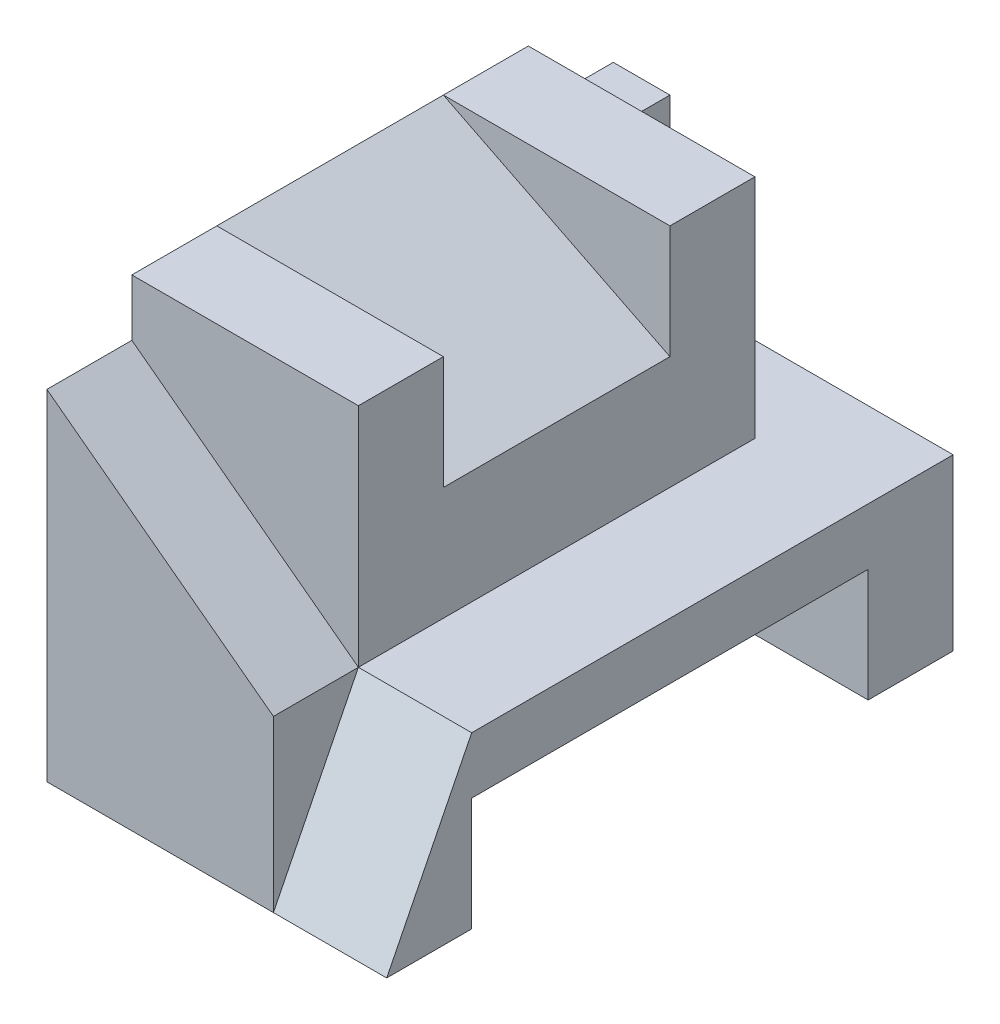
ISO-10303-21;
HEADER;
FILE_DESCRIPTION(('STEP AP214'),'2;1');
FILE_NAME('part.step','',(''),(''),'','','');
FILE_SCHEMA(('AUTOMOTIVE_DESIGN { 1 0 10303 214 1 1 1 1 }'));
ENDSEC;
DATA;
#1=APPLICATION_CONTEXT('core data for automotive mechanical design processes');
#2=APPLICATION_PROTOCOL_DEFINITION('international standard','automotive_design',2000,#1);
#3=PRODUCT_CONTEXT('',#1,'mechanical');
#4=PRODUCT('Part','Part','',(#3));
#5=PRODUCT_RELATED_PRODUCT_CATEGORY('part','',(#4));
#6=PRODUCT_DEFINITION_FORMATION('','',#4);
#7=PRODUCT_DEFINITION_CONTEXT('part definition',#1,'design');
#8=PRODUCT_DEFINITION('design','',#6,#7);
#9=PRODUCT_DEFINITION_SHAPE('','',#8);
#10=(LENGTH_UNIT() NAMED_UNIT(*) SI_UNIT(.MILLI.,.METRE.));
#11=(NAMED_UNIT(*) PLANE_ANGLE_UNIT() SI_UNIT($,.RADIAN.));
#12=(NAMED_UNIT(*) SI_UNIT($,.STERADIAN.) SOLID_ANGLE_UNIT());
#13=UNCERTAINTY_MEASURE_WITH_UNIT(LENGTH_MEASURE(1.E-05),#10,'distance_accuracy_value','');
#14=(GEOMETRIC_REPRESENTATION_CONTEXT(3) GLOBAL_UNCERTAINTY_ASSIGNED_CONTEXT((#13)) GLOBAL_UNIT_ASSIGNED_CONTEXT((#10,
#11,#12)) REPRESENTATION_CONTEXT('',''));
#15=CARTESIAN_POINT('',(0.,0.,0.));
#16=DIRECTION('',(0.,0.,1.));
#17=DIRECTION('',(1.,0.,0.));
#18=AXIS2_PLACEMENT_3D('',#15,#16,#17);
#19=CARTESIAN_POINT('',(4.,7.,-10.));
#20=DIRECTION('',(0.,1.,0.));
#21=DIRECTION('',(-1.,0.,0.));
#22=AXIS2_PLACEMENT_3D('',#19,#20,#21);
#23=PLANE('',#22);
#24=DIRECTION('',(0.,0.,1.));
#25=VECTOR('',#24,1.);
#26=CARTESIAN_POINT('',(4.,7.,-10.));
#27=LINE('',#26,#25);
#28=CARTESIAN_POINT('',(4.,7.,-3.));
#29=VERTEX_POINT('',#28);
#30=CARTESIAN_POINT('',(4.,7.,-1.5));
#31=VERTEX_POINT('',#30);
#32=EDGE_CURVE('E294',#29,#31,#27,.T.);
#33=ORIENTED_EDGE('',*,*,#32,.F.);
#34=DIRECTION('',(-1.,0.,0.));
#35=VECTOR('',#34,1.);
#36=CARTESIAN_POINT('',(4.,7.,-3.));
#37=LINE('',#36,#35);
#38=CARTESIAN_POINT('',(0.,7.,-3.));
#39=VERTEX_POINT('',#38);
#40=EDGE_CURVE('E187',#29,#39,#37,.T.);
#41=ORIENTED_EDGE('',*,*,#40,.T.);
#42=DIRECTION('',(0.,0.,1.));
#43=VECTOR('',#42,1.);
#44=CARTESIAN_POINT('',(0.,7.,-10.));
#45=LINE('',#44,#43);
#46=CARTESIAN_POINT('',(0.,7.,-1.5));
#47=VERTEX_POINT('',#46);
#48=EDGE_CURVE('E43',#39,#47,#45,.T.);
#49=ORIENTED_EDGE('',*,*,#48,.T.);
#50=DIRECTION('',(-1.,0.,0.));
#51=VECTOR('',#50,1.);
#52=CARTESIAN_POINT('',(0.,7.,-1.5));
#53=LINE('',#52,#51);
#54=EDGE_CURVE('E262',#31,#47,#53,.T.);
#55=ORIENTED_EDGE('',*,*,#54,.F.);
#56=EDGE_LOOP('',(#33,#41,#49,#55));
#57=FACE_BOUND('',#56,.T.);
#58=ADVANCED_FACE('F34',(#57),#23,.T.);
#59=CARTESIAN_POINT('',(0.,0.,-10.));
#60=DIRECTION('',(0.,-1.,0.));
#61=DIRECTION('',(0.,0.,-1.));
#62=AXIS2_PLACEMENT_3D('',#59,#60,#61);
#63=PLANE('',#62);
#64=DIRECTION('',(1.,0.,0.));
#65=VECTOR('',#64,1.);
#66=CARTESIAN_POINT('',(-0.00100000000000013,0.,-1.5));
#67=LINE('',#66,#65);
#68=CARTESIAN_POINT('',(0.,0.,-1.5));
#69=VERTEX_POINT('',#68);
#70=CARTESIAN_POINT('',(6.,0.,-1.5));
#71=VERTEX_POINT('',#70);
#72=EDGE_CURVE('E236',#69,#71,#67,.T.);
#73=ORIENTED_EDGE('',*,*,#72,.T.);
#74=DIRECTION('',(0.,0.,1.));
#75=VECTOR('',#74,1.);
#76=CARTESIAN_POINT('',(6.,0.,-10.));
#77=LINE('',#76,#75);
#78=CARTESIAN_POINT('',(6.,0.,0.));
#79=VERTEX_POINT('',#78);
#80=EDGE_CURVE('E301',#71,#79,#77,.T.);
#81=ORIENTED_EDGE('',*,*,#80,.T.);
#82=DIRECTION('',(1.,0.,0.));
#83=VECTOR('',#82,1.);
#84=CARTESIAN_POINT('',(4.,0.,0.));
#85=LINE('',#84,#83);
#86=CARTESIAN_POINT('',(4.,0.,0.));
#87=VERTEX_POINT('',#86);
#88=EDGE_CURVE('E251',#87,#79,#85,.T.);
#89=ORIENTED_EDGE('',*,*,#88,.F.);
#90=DIRECTION('',(1.,0.,0.));
#91=VECTOR('',#90,1.);
#92=CARTESIAN_POINT('',(0.,0.,0.));
#93=LINE('',#92,#91);
#94=CARTESIAN_POINT('',(0.,0.,0.));
#95=VERTEX_POINT('',#94);
#96=EDGE_CURVE('E280',#95,#87,#93,.T.);
#97=ORIENTED_EDGE('',*,*,#96,.F.);
#98=DIRECTION('',(0.,0.,1.));
#99=VECTOR('',#98,1.);
#100=CARTESIAN_POINT('',(0.,0.,-10.));
#101=LINE('',#100,#99);
#102=EDGE_CURVE('E288',#69,#95,#101,.T.);
#103=ORIENTED_EDGE('',*,*,#102,.F.);
#104=EDGE_LOOP('',(#73,#81,#89,#97,#103));
#105=FACE_BOUND('',#104,.T.);
#106=ADVANCED_FACE('F317',(#105),#63,.T.);
#107=CARTESIAN_POINT('',(0.,0.,0.));
#108=DIRECTION('',(0.,0.,1.));
#109=DIRECTION('',(1.,0.,0.));
#110=AXIS2_PLACEMENT_3D('',#107,#108,#109);
#111=PLANE('',#110);
#112=ORIENTED_EDGE('',*,*,#96,.T.);
#113=DIRECTION('',(0.,-1.,0.));
#114=VECTOR('',#113,1.);
#115=CARTESIAN_POINT('',(4.,0.,0.));
#116=LINE('',#115,#114);
#117=CARTESIAN_POINT('',(4.,3.,0.));
#118=VERTEX_POINT('',#117);
#119=EDGE_CURVE('E246',#118,#87,#116,.T.);
#120=ORIENTED_EDGE('',*,*,#119,.F.);
#121=DIRECTION('',(0.8,-0.6,0.));
#122=VECTOR('',#121,1.);
#123=CARTESIAN_POINT('',(4.,3.,0.));
#124=LINE('',#123,#122);
#125=CARTESIAN_POINT('',(0.,6.,0.));
#126=VERTEX_POINT('',#125);
#127=EDGE_CURVE('E256',#126,#118,#124,.T.);
#128=ORIENTED_EDGE('',*,*,#127,.F.);
#129=DIRECTION('',(0.,-1.,0.));
#130=VECTOR('',#129,1.);
#131=CARTESIAN_POINT('',(0.,7.,0.));
#132=LINE('',#131,#130);
#133=EDGE_CURVE('E275',#126,#95,#132,.T.);
#134=ORIENTED_EDGE('',*,*,#133,.T.);
#135=EDGE_LOOP('',(#112,#120,#128,#134));
#136=FACE_BOUND('',#135,.T.);
#137=ADVANCED_FACE('F315',(#136),#111,.T.);
#138=DIRECTION('',(-1.,0.,0.));
#139=VECTOR('',#138,1.);
#140=CARTESIAN_POINT('',(4.,7.,-7.));
#141=LINE('',#140,#139);
#142=CARTESIAN_POINT('',(4.,7.,-7.));
#143=VERTEX_POINT('',#142);
#144=CARTESIAN_POINT('',(0.,7.,-7.));
#145=VERTEX_POINT('',#144);
#146=EDGE_CURVE('E51',#143,#145,#141,.T.);
#147=ORIENTED_EDGE('',*,*,#146,.F.);
#148=CARTESIAN_POINT('',(4.,7.,-8.5));
#149=VERTEX_POINT('',#148);
#150=EDGE_CURVE('E182',#149,#143,#27,.T.);
#151=ORIENTED_EDGE('',*,*,#150,.F.);
#152=DIRECTION('',(1.,0.,0.));
#153=VECTOR('',#152,1.);
#154=CARTESIAN_POINT('',(4.,7.,-8.5));
#155=LINE('',#154,#153);
#156=CARTESIAN_POINT('',(0.,7.,-8.5));
#157=VERTEX_POINT('',#156);
#158=EDGE_CURVE('E208',#157,#149,#155,.T.);
#159=ORIENTED_EDGE('',*,*,#158,.F.);
#160=EDGE_CURVE('E11',#157,#145,#45,.T.);
#161=ORIENTED_EDGE('',*,*,#160,.T.);
#162=EDGE_LOOP('',(#147,#151,#159,#161));
#163=FACE_BOUND('',#162,.T.);
#164=ADVANCED_FACE('F373',(#163),#23,.T.);
#165=CARTESIAN_POINT('',(4.,3.,-10.));
#166=DIRECTION('',(1.,0.,0.));
#167=DIRECTION('',(0.,0.,-1.));
#168=AXIS2_PLACEMENT_3D('',#165,#166,#167);
#169=PLANE('',#168);
#170=DIRECTION('',(0.,1.,0.));
#171=VECTOR('',#170,1.);
#172=CARTESIAN_POINT('',(4.,5.,-7.));
#173=LINE('',#172,#171);
#174=CARTESIAN_POINT('',(4.,5.,-7.));
#175=VERTEX_POINT('',#174);
#176=EDGE_CURVE('E176',#175,#143,#173,.T.);
#177=ORIENTED_EDGE('',*,*,#176,.F.);
#178=DIRECTION('',(0.,0.,1.));
#179=VECTOR('',#178,1.);
#180=CARTESIAN_POINT('',(4.,5.,-7.));
#181=LINE('',#180,#179);
#182=CARTESIAN_POINT('',(4.,5.,-3.));
#183=VERTEX_POINT('',#182);
#184=EDGE_CURVE('E162',#175,#183,#181,.T.);
#185=ORIENTED_EDGE('',*,*,#184,.T.);
#186=DIRECTION('',(0.,1.,0.));
#187=VECTOR('',#186,1.);
#188=CARTESIAN_POINT('',(4.,5.,-3.));
#189=LINE('',#188,#187);
#190=EDGE_CURVE('E191',#183,#29,#189,.T.);
#191=ORIENTED_EDGE('',*,*,#190,.T.);
#192=ORIENTED_EDGE('',*,*,#32,.T.);
#193=DIRECTION('',(0.,1.,0.));
#194=VECTOR('',#193,1.);
#195=CARTESIAN_POINT('',(4.,7.,-1.5));
#196=LINE('',#195,#194);
#197=CARTESIAN_POINT('',(4.,3.,-1.5));
#198=VERTEX_POINT('',#197);
#199=EDGE_CURVE('E259',#198,#31,#196,.T.);
#200=ORIENTED_EDGE('',*,*,#199,.F.);
#201=DIRECTION('',(0.,0.,1.));
#202=VECTOR('',#201,1.);
#203=CARTESIAN_POINT('',(4.,3.,-10.));
#204=LINE('',#203,#202);
#205=CARTESIAN_POINT('',(4.,3.,-8.5));
#206=VERTEX_POINT('',#205);
#207=EDGE_CURVE('E295',#206,#198,#204,.T.);
#208=ORIENTED_EDGE('',*,*,#207,.F.);
#209=DIRECTION('',(0.,-1.,0.));
#210=VECTOR('',#209,1.);
#211=CARTESIAN_POINT('',(4.,3.,-8.5));
#212=LINE('',#211,#210);
#213=EDGE_CURVE('E193',#149,#206,#212,.T.);
#214=ORIENTED_EDGE('',*,*,#213,.F.);
#215=ORIENTED_EDGE('',*,*,#150,.T.);
#216=EDGE_LOOP('',(#177,#185,#191,#192,#200,#208,#214,#215));
#217=FACE_BOUND('',#216,.T.);
#218=ADVANCED_FACE('F179',(#217),#169,.T.);
#219=CARTESIAN_POINT('',(0.,7.,-10.));
#220=DIRECTION('',(-1.,0.,0.));
#221=DIRECTION('',(0.,-1.,0.));
#222=AXIS2_PLACEMENT_3D('',#219,#220,#221);
#223=PLANE('',#222);
#224=DIRECTION('',(0.,0.,-1.));
#225=VECTOR('',#224,1.);
#226=CARTESIAN_POINT('',(0.,6.,-8.5));
#227=LINE('',#226,#225);
#228=CARTESIAN_POINT('',(0.,6.,-8.5));
#229=VERTEX_POINT('',#228);
#230=CARTESIAN_POINT('',(0.,6.,-10.));
#231=VERTEX_POINT('',#230);
#232=EDGE_CURVE('E214',#229,#231,#227,.T.);
#233=ORIENTED_EDGE('',*,*,#232,.T.);
#234=DIRECTION('',(0.,-1.,0.));
#235=VECTOR('',#234,1.);
#236=CARTESIAN_POINT('',(0.,7.,-10.));
#237=LINE('',#236,#235);
#238=CARTESIAN_POINT('',(0.,0.,-10.));
#239=VERTEX_POINT('',#238);
#240=EDGE_CURVE('E277',#231,#239,#237,.T.);
#241=ORIENTED_EDGE('',*,*,#240,.T.);
#242=CARTESIAN_POINT('',(0.,0.,-8.5));
#243=VERTEX_POINT('',#242);
#244=EDGE_CURVE('E38',#239,#243,#101,.T.);
#245=ORIENTED_EDGE('',*,*,#244,.T.);
#246=DIRECTION('',(0.,1.,0.));
#247=VECTOR('',#246,1.);
#248=CARTESIAN_POINT('',(0.,2.,-8.5));
#249=LINE('',#248,#247);
#250=CARTESIAN_POINT('',(0.,2.,-8.5));
#251=VERTEX_POINT('',#250);
#252=EDGE_CURVE('E59',#243,#251,#249,.T.);
#253=ORIENTED_EDGE('',*,*,#252,.T.);
#254=DIRECTION('',(0.,0.,1.));
#255=VECTOR('',#254,1.);
#256=CARTESIAN_POINT('',(0.,2.,-1.5));
#257=LINE('',#256,#255);
#258=CARTESIAN_POINT('',(0.,2.,-1.5));
#259=VERTEX_POINT('',#258);
#260=EDGE_CURVE('E217',#251,#259,#257,.T.);
#261=ORIENTED_EDGE('',*,*,#260,.T.);
#262=DIRECTION('',(0.,-1.,0.));
#263=VECTOR('',#262,1.);
#264=CARTESIAN_POINT('',(0.,0.,-1.5));
#265=LINE('',#264,#263);
#266=EDGE_CURVE('E224',#259,#69,#265,.T.);
#267=ORIENTED_EDGE('',*,*,#266,.T.);
#268=ORIENTED_EDGE('',*,*,#102,.T.);
#269=ORIENTED_EDGE('',*,*,#133,.F.);
#270=DIRECTION('',(0.,0.,1.));
#271=VECTOR('',#270,1.);
#272=CARTESIAN_POINT('',(0.,6.,-1.5));
#273=LINE('',#272,#271);
#274=CARTESIAN_POINT('',(0.,6.,-1.5));
#275=VERTEX_POINT('',#274);
#276=EDGE_CURVE('E270',#275,#126,#273,.T.);
#277=ORIENTED_EDGE('',*,*,#276,.F.);
#278=DIRECTION('',(0.,-1.,0.));
#279=VECTOR('',#278,1.);
#280=CARTESIAN_POINT('',(0.,6.,-1.5));
#281=LINE('',#280,#279);
#282=EDGE_CURVE('E265',#47,#275,#281,.T.);
#283=ORIENTED_EDGE('',*,*,#282,.F.);
#284=ORIENTED_EDGE('',*,*,#48,.F.);
#285=DIRECTION('',(0.,0.,1.));
#286=VECTOR('',#285,1.);
#287=CARTESIAN_POINT('',(0.,7.,-7.));
#288=LINE('',#287,#286);
#289=EDGE_CURVE('E173',#145,#39,#288,.T.);
#290=ORIENTED_EDGE('',*,*,#289,.F.);
#291=ORIENTED_EDGE('',*,*,#160,.F.);
#292=DIRECTION('',(0.,1.,0.));
#293=VECTOR('',#292,1.);
#294=CARTESIAN_POINT('',(0.,6.,-8.5));
#295=LINE('',#294,#293);
#296=EDGE_CURVE('E206',#229,#157,#295,.T.);
#297=ORIENTED_EDGE('',*,*,#296,.F.);
#298=EDGE_LOOP('',(#233,#241,#245,#253,#261,#267,#268,#269,#277,#283,#284,#290,#291,#297));
#299=FACE_BOUND('',#298,.T.);
#300=ADVANCED_FACE('F36',(#299),#223,.T.);
#301=CARTESIAN_POINT('',(6.,3.,-10.));
#302=DIRECTION('',(0.,1.,0.));
#303=DIRECTION('',(-1.,0.,0.));
#304=AXIS2_PLACEMENT_3D('',#301,#302,#303);
#305=PLANE('',#304);
#306=DIRECTION('',(1.,0.,0.));
#307=VECTOR('',#306,1.);
#308=CARTESIAN_POINT('',(4.,3.,-1.5));
#309=LINE('',#308,#307);
#310=CARTESIAN_POINT('',(6.,3.,-1.5));
#311=VERTEX_POINT('',#310);
#312=EDGE_CURVE('E253',#198,#311,#309,.T.);
#313=ORIENTED_EDGE('',*,*,#312,.T.);
#314=DIRECTION('',(0.,0.,1.));
#315=VECTOR('',#314,1.);
#316=CARTESIAN_POINT('',(6.,3.,-10.));
#317=LINE('',#316,#315);
#318=CARTESIAN_POINT('',(6.,3.,-10.));
#319=VERTEX_POINT('',#318);
#320=EDGE_CURVE('E297',#319,#311,#317,.T.);
#321=ORIENTED_EDGE('',*,*,#320,.F.);
#322=DIRECTION('',(-1.,0.,0.));
#323=VECTOR('',#322,1.);
#324=CARTESIAN_POINT('',(6.,3.,-10.));
#325=LINE('',#324,#323);
#326=CARTESIAN_POINT('',(1.,3.,-10.));
#327=VERTEX_POINT('',#326);
#328=EDGE_CURVE('E286',#319,#327,#325,.T.);
#329=ORIENTED_EDGE('',*,*,#328,.T.);
#330=DIRECTION('',(0.,0.,-1.));
#331=VECTOR('',#330,1.);
#332=CARTESIAN_POINT('',(1.,3.,-8.5));
#333=LINE('',#332,#331);
#334=CARTESIAN_POINT('',(1.,3.,-8.5));
#335=VERTEX_POINT('',#334);
#336=EDGE_CURVE('E210',#335,#327,#333,.T.);
#337=ORIENTED_EDGE('',*,*,#336,.F.);
#338=DIRECTION('',(-1.,0.,0.));
#339=VECTOR('',#338,1.);
#340=CARTESIAN_POINT('',(4.,3.,-8.5));
#341=LINE('',#340,#339);
#342=EDGE_CURVE('E196',#206,#335,#341,.T.);
#343=ORIENTED_EDGE('',*,*,#342,.F.);
#344=ORIENTED_EDGE('',*,*,#207,.T.);
#345=EDGE_LOOP('',(#313,#321,#329,#337,#343,#344));
#346=FACE_BOUND('',#345,.T.);
#347=ADVANCED_FACE('F329',(#346),#305,.T.);
#348=CARTESIAN_POINT('',(6.,0.,-10.));
#349=DIRECTION('',(1.,0.,0.));
#350=DIRECTION('',(0.,0.,-1.));
#351=AXIS2_PLACEMENT_3D('',#348,#349,#350);
#352=PLANE('',#351);
#353=DIRECTION('',(0.,-1.,0.));
#354=VECTOR('',#353,1.);
#355=CARTESIAN_POINT('',(6.,0.,-1.5));
#356=LINE('',#355,#354);
#357=CARTESIAN_POINT('',(6.,2.,-1.5));
#358=VERTEX_POINT('',#357);
#359=EDGE_CURVE('E233',#358,#71,#356,.T.);
#360=ORIENTED_EDGE('',*,*,#359,.F.);
#361=DIRECTION('',(0.,0.,1.));
#362=VECTOR('',#361,1.);
#363=CARTESIAN_POINT('',(6.,2.,-1.5));
#364=LINE('',#363,#362);
#365=CARTESIAN_POINT('',(6.,2.,-8.5));
#366=VERTEX_POINT('',#365);
#367=EDGE_CURVE('E230',#366,#358,#364,.T.);
#368=ORIENTED_EDGE('',*,*,#367,.F.);
#369=DIRECTION('',(0.,1.,0.));
#370=VECTOR('',#369,1.);
#371=CARTESIAN_POINT('',(6.,2.,-8.5));
#372=LINE('',#371,#370);
#373=CARTESIAN_POINT('',(6.,0.,-8.5));
#374=VERTEX_POINT('',#373);
#375=EDGE_CURVE('E227',#374,#366,#372,.T.);
#376=ORIENTED_EDGE('',*,*,#375,.F.);
#377=CARTESIAN_POINT('',(6.,0.,-10.));
#378=VERTEX_POINT('',#377);
#379=EDGE_CURVE('E299',#378,#374,#77,.T.);
#380=ORIENTED_EDGE('',*,*,#379,.F.);
#381=DIRECTION('',(0.,1.,0.));
#382=VECTOR('',#381,1.);
#383=CARTESIAN_POINT('',(6.,0.,-10.));
#384=LINE('',#383,#382);
#385=EDGE_CURVE('E283',#378,#319,#384,.T.);
#386=ORIENTED_EDGE('',*,*,#385,.T.);
#387=ORIENTED_EDGE('',*,*,#320,.T.);
#388=DIRECTION('',(0.,0.894427190999916,-0.447213595499958));
#389=VECTOR('',#388,1.);
#390=CARTESIAN_POINT('',(6.,3.,-1.5));
#391=LINE('',#390,#389);
#392=EDGE_CURVE('E245',#79,#311,#391,.T.);
#393=ORIENTED_EDGE('',*,*,#392,.F.);
#394=ORIENTED_EDGE('',*,*,#80,.F.);
#395=EDGE_LOOP('',(#360,#368,#376,#380,#386,#387,#393,#394));
#396=FACE_BOUND('',#395,.T.);
#397=ADVANCED_FACE('F325',(#396),#352,.T.);
#398=DIRECTION('',(1.,0.,0.));
#399=VECTOR('',#398,1.);
#400=CARTESIAN_POINT('',(-0.00100000000000013,0.,-8.5));
#401=LINE('',#400,#399);
#402=EDGE_CURVE('E235',#243,#374,#401,.T.);
#403=ORIENTED_EDGE('',*,*,#402,.F.);
#404=ORIENTED_EDGE('',*,*,#244,.F.);
#405=DIRECTION('',(1.,0.,0.));
#406=VECTOR('',#405,1.);
#407=CARTESIAN_POINT('',(0.,0.,-10.));
#408=LINE('',#407,#406);
#409=EDGE_CURVE('E279',#239,#378,#408,.T.);
#410=ORIENTED_EDGE('',*,*,#409,.T.);
#411=ORIENTED_EDGE('',*,*,#379,.T.);
#412=EDGE_LOOP('',(#403,#404,#410,#411));
#413=FACE_BOUND('',#412,.T.);
#414=ADVANCED_FACE('F377',(#413),#63,.T.);
#415=CARTESIAN_POINT('',(0.,0.,-10.));
#416=DIRECTION('',(0.,0.,1.));
#417=DIRECTION('',(1.,0.,0.));
#418=AXIS2_PLACEMENT_3D('',#415,#416,#417);
#419=PLANE('',#418);
#420=ORIENTED_EDGE('',*,*,#240,.F.);
#421=DIRECTION('',(-1.,0.,0.));
#422=VECTOR('',#421,1.);
#423=CARTESIAN_POINT('',(1.,6.,-10.));
#424=LINE('',#423,#422);
#425=CARTESIAN_POINT('',(1.,6.,-10.));
#426=VERTEX_POINT('',#425);
#427=EDGE_CURVE('E197',#426,#231,#424,.T.);
#428=ORIENTED_EDGE('',*,*,#427,.F.);
#429=DIRECTION('',(0.,1.,0.));
#430=VECTOR('',#429,1.);
#431=CARTESIAN_POINT('',(1.,3.,-10.));
#432=LINE('',#431,#430);
#433=EDGE_CURVE('E172',#327,#426,#432,.T.);
#434=ORIENTED_EDGE('',*,*,#433,.F.);
#435=ORIENTED_EDGE('',*,*,#328,.F.);
#436=ORIENTED_EDGE('',*,*,#385,.F.);
#437=ORIENTED_EDGE('',*,*,#409,.F.);
#438=EDGE_LOOP('',(#420,#428,#434,#435,#436,#437));
#439=FACE_BOUND('',#438,.T.);
#440=ADVANCED_FACE('F333',(#439),#419,.F.);
#441=CARTESIAN_POINT('',(4.,3.,-1.5));
#442=DIRECTION('',(-0.6,-0.8,0.));
#443=DIRECTION('',(0.8,-0.6,0.));
#444=AXIS2_PLACEMENT_3D('',#441,#442,#443);
#445=PLANE('',#444);
#446=ORIENTED_EDGE('',*,*,#127,.T.);
#447=DIRECTION('',(0.,0.,1.));
#448=VECTOR('',#447,1.);
#449=CARTESIAN_POINT('',(4.,3.,-1.5));
#450=LINE('',#449,#448);
#451=EDGE_CURVE('E273',#198,#118,#450,.T.);
#452=ORIENTED_EDGE('',*,*,#451,.F.);
#453=DIRECTION('',(0.8,-0.6,0.));
#454=VECTOR('',#453,1.);
#455=CARTESIAN_POINT('',(4.,3.,-1.5));
#456=LINE('',#455,#454);
#457=EDGE_CURVE('E267',#275,#198,#456,.T.);
#458=ORIENTED_EDGE('',*,*,#457,.F.);
#459=ORIENTED_EDGE('',*,*,#276,.T.);
#460=EDGE_LOOP('',(#446,#452,#458,#459));
#461=FACE_BOUND('',#460,.T.);
#462=ADVANCED_FACE('F356',(#461),#445,.F.);
#463=CARTESIAN_POINT('',(0.,0.,-1.5));
#464=DIRECTION('',(0.,0.,1.));
#465=DIRECTION('',(1.,0.,0.));
#466=AXIS2_PLACEMENT_3D('',#463,#464,#465);
#467=PLANE('',#466);
#468=ORIENTED_EDGE('',*,*,#199,.T.);
#469=ORIENTED_EDGE('',*,*,#54,.T.);
#470=ORIENTED_EDGE('',*,*,#282,.T.);
#471=ORIENTED_EDGE('',*,*,#457,.T.);
#472=EDGE_LOOP('',(#468,#469,#470,#471));
#473=FACE_BOUND('',#472,.T.);
#474=ADVANCED_FACE('F348',(#473),#467,.T.);
#475=CARTESIAN_POINT('',(4.,3.,-1.5));
#476=DIRECTION('',(0.,-0.447213595499958,-0.894427190999916));
#477=DIRECTION('',(0.,0.894427190999916,-0.447213595499958));
#478=AXIS2_PLACEMENT_3D('',#475,#476,#477);
#479=PLANE('',#478);
#480=ORIENTED_EDGE('',*,*,#392,.T.);
#481=ORIENTED_EDGE('',*,*,#312,.F.);
#482=DIRECTION('',(0.,0.894427190999916,-0.447213595499958));
#483=VECTOR('',#482,1.);
#484=CARTESIAN_POINT('',(4.,3.,-1.5));
#485=LINE('',#484,#483);
#486=EDGE_CURVE('E248',#87,#198,#485,.T.);
#487=ORIENTED_EDGE('',*,*,#486,.F.);
#488=ORIENTED_EDGE('',*,*,#88,.T.);
#489=EDGE_LOOP('',(#480,#481,#487,#488));
#490=FACE_BOUND('',#489,.T.);
#491=ADVANCED_FACE('F321',(#490),#479,.F.);
#492=CARTESIAN_POINT('',(4.,0.,0.));
#493=DIRECTION('',(1.,0.,0.));
#494=DIRECTION('',(0.,0.,-1.));
#495=AXIS2_PLACEMENT_3D('',#492,#493,#494);
#496=PLANE('',#495);
#497=ORIENTED_EDGE('',*,*,#451,.T.);
#498=ORIENTED_EDGE('',*,*,#119,.T.);
#499=ORIENTED_EDGE('',*,*,#486,.T.);
#500=EDGE_LOOP('',(#497,#498,#499));
#501=FACE_BOUND('',#500,.T.);
#502=ADVANCED_FACE('F358',(#501),#496,.T.);
#503=CARTESIAN_POINT('',(-0.00100000000000013,0.,-1.5));
#504=DIRECTION('',(0.,0.,1.));
#505=DIRECTION('',(1.,0.,0.));
#506=AXIS2_PLACEMENT_3D('',#503,#504,#505);
#507=PLANE('',#506);
#508=DIRECTION('',(1.,0.,0.));
#509=VECTOR('',#508,1.);
#510=CARTESIAN_POINT('',(-0.00100000000000013,2.,-1.5));
#511=LINE('',#510,#509);
#512=EDGE_CURVE('E239',#259,#358,#511,.T.);
#513=ORIENTED_EDGE('',*,*,#512,.T.);
#514=ORIENTED_EDGE('',*,*,#359,.T.);
#515=ORIENTED_EDGE('',*,*,#72,.F.);
#516=ORIENTED_EDGE('',*,*,#266,.F.);
#517=EDGE_LOOP('',(#513,#514,#515,#516));
#518=FACE_BOUND('',#517,.T.);
#519=ADVANCED_FACE('F360',(#518),#507,.F.);
#520=CARTESIAN_POINT('',(-0.00100000000000013,2.,-1.5));
#521=DIRECTION('',(0.,1.,0.));
#522=DIRECTION('',(0.,0.,1.));
#523=AXIS2_PLACEMENT_3D('',#520,#521,#522);
#524=PLANE('',#523);
#525=DIRECTION('',(1.,0.,0.));
#526=VECTOR('',#525,1.);
#527=CARTESIAN_POINT('',(-0.00100000000000013,2.,-8.5));
#528=LINE('',#527,#526);
#529=EDGE_CURVE('E241',#251,#366,#528,.T.);
#530=ORIENTED_EDGE('',*,*,#529,.T.);
#531=ORIENTED_EDGE('',*,*,#367,.T.);
#532=ORIENTED_EDGE('',*,*,#512,.F.);
#533=ORIENTED_EDGE('',*,*,#260,.F.);
#534=EDGE_LOOP('',(#530,#531,#532,#533));
#535=FACE_BOUND('',#534,.T.);
#536=ADVANCED_FACE('F366',(#535),#524,.F.);
#537=CARTESIAN_POINT('',(-0.00100000000000013,2.,-8.5));
#538=DIRECTION('',(0.,0.,-1.));
#539=DIRECTION('',(-1.,0.,0.));
#540=AXIS2_PLACEMENT_3D('',#537,#538,#539);
#541=PLANE('',#540);
#542=ORIENTED_EDGE('',*,*,#402,.T.);
#543=ORIENTED_EDGE('',*,*,#375,.T.);
#544=ORIENTED_EDGE('',*,*,#529,.F.);
#545=ORIENTED_EDGE('',*,*,#252,.F.);
#546=EDGE_LOOP('',(#542,#543,#544,#545));
#547=FACE_BOUND('',#546,.T.);
#548=ADVANCED_FACE('F390',(#547),#541,.F.);
#549=CARTESIAN_POINT('',(1.,6.,-8.5));
#550=DIRECTION('',(0.,-1.,0.));
#551=DIRECTION('',(0.,0.,-1.));
#552=AXIS2_PLACEMENT_3D('',#549,#550,#551);
#553=PLANE('',#552);
#554=ORIENTED_EDGE('',*,*,#427,.T.);
#555=ORIENTED_EDGE('',*,*,#232,.F.);
#556=DIRECTION('',(-1.,0.,0.));
#557=VECTOR('',#556,1.);
#558=CARTESIAN_POINT('',(1.,6.,-8.5));
#559=LINE('',#558,#557);
#560=CARTESIAN_POINT('',(1.,6.,-8.5));
#561=VERTEX_POINT('',#560);
#562=EDGE_CURVE('E203',#561,#229,#559,.T.);
#563=ORIENTED_EDGE('',*,*,#562,.F.);
#564=DIRECTION('',(0.,0.,-1.));
#565=VECTOR('',#564,1.);
#566=CARTESIAN_POINT('',(1.,6.,-8.5));
#567=LINE('',#566,#565);
#568=EDGE_CURVE('E218',#561,#426,#567,.T.);
#569=ORIENTED_EDGE('',*,*,#568,.T.);
#570=EDGE_LOOP('',(#554,#555,#563,#569));
#571=FACE_BOUND('',#570,.T.);
#572=ADVANCED_FACE('F388',(#571),#553,.F.);
#573=CARTESIAN_POINT('',(1.,3.,-8.5));
#574=DIRECTION('',(-1.,0.,0.));
#575=DIRECTION('',(0.,0.,1.));
#576=AXIS2_PLACEMENT_3D('',#573,#574,#575);
#577=PLANE('',#576);
#578=ORIENTED_EDGE('',*,*,#433,.T.);
#579=ORIENTED_EDGE('',*,*,#568,.F.);
#580=DIRECTION('',(0.,1.,0.));
#581=VECTOR('',#580,1.);
#582=CARTESIAN_POINT('',(1.,3.,-8.5));
#583=LINE('',#582,#581);
#584=EDGE_CURVE('E200',#335,#561,#583,.T.);
#585=ORIENTED_EDGE('',*,*,#584,.F.);
#586=ORIENTED_EDGE('',*,*,#336,.T.);
#587=EDGE_LOOP('',(#578,#579,#585,#586));
#588=FACE_BOUND('',#587,.T.);
#589=ADVANCED_FACE('F337',(#588),#577,.F.);
#590=CARTESIAN_POINT('',(0.,0.,-8.5));
#591=DIRECTION('',(0.,0.,1.));
#592=DIRECTION('',(1.,0.,0.));
#593=AXIS2_PLACEMENT_3D('',#590,#591,#592);
#594=PLANE('',#593);
#595=ORIENTED_EDGE('',*,*,#213,.T.);
#596=ORIENTED_EDGE('',*,*,#342,.T.);
#597=ORIENTED_EDGE('',*,*,#584,.T.);
#598=ORIENTED_EDGE('',*,*,#562,.T.);
#599=ORIENTED_EDGE('',*,*,#296,.T.);
#600=ORIENTED_EDGE('',*,*,#158,.T.);
#601=EDGE_LOOP('',(#595,#596,#597,#598,#599,#600));
#602=FACE_BOUND('',#601,.T.);
#603=ADVANCED_FACE('F342',(#602),#594,.F.);
#604=CARTESIAN_POINT('',(0.,7.,-7.));
#605=DIRECTION('',(-0.447213595499958,-0.894427190999916,0.));
#606=DIRECTION('',(0.894427190999916,-0.447213595499958,0.));
#607=AXIS2_PLACEMENT_3D('',#604,#605,#606);
#608=PLANE('',#607);
#609=DIRECTION('',(0.894427190999916,-0.447213595499958,0.));
#610=VECTOR('',#609,1.);
#611=CARTESIAN_POINT('',(0.,7.,-3.));
#612=LINE('',#611,#610);
#613=EDGE_CURVE('E167',#39,#183,#612,.T.);
#614=ORIENTED_EDGE('',*,*,#613,.T.);
#615=ORIENTED_EDGE('',*,*,#184,.F.);
#616=DIRECTION('',(0.894427190999916,-0.447213595499958,0.));
#617=VECTOR('',#616,1.);
#618=CARTESIAN_POINT('',(0.,7.,-7.));
#619=LINE('',#618,#617);
#620=EDGE_CURVE('E164',#145,#175,#619,.T.);
#621=ORIENTED_EDGE('',*,*,#620,.F.);
#622=ORIENTED_EDGE('',*,*,#289,.T.);
#623=EDGE_LOOP('',(#614,#615,#621,#622));
#624=FACE_BOUND('',#623,.T.);
#625=ADVANCED_FACE('F163',(#624),#608,.F.);
#626=CARTESIAN_POINT('',(0.,0.,-7.));
#627=DIRECTION('',(0.,0.,-1.));
#628=DIRECTION('',(-1.,0.,0.));
#629=AXIS2_PLACEMENT_3D('',#626,#627,#628);
#630=PLANE('',#629);
#631=ORIENTED_EDGE('',*,*,#146,.T.);
#632=ORIENTED_EDGE('',*,*,#620,.T.);
#633=ORIENTED_EDGE('',*,*,#176,.T.);
#634=EDGE_LOOP('',(#631,#632,#633));
#635=FACE_BOUND('',#634,.T.);
#636=ADVANCED_FACE('F175',(#635),#630,.F.);
#637=CARTESIAN_POINT('',(0.,0.,-3.));
#638=DIRECTION('',(0.,0.,-1.));
#639=DIRECTION('',(-1.,0.,0.));
#640=AXIS2_PLACEMENT_3D('',#637,#638,#639);
#641=PLANE('',#640);
#642=ORIENTED_EDGE('',*,*,#40,.F.);
#643=ORIENTED_EDGE('',*,*,#190,.F.);
#644=ORIENTED_EDGE('',*,*,#613,.F.);
#645=EDGE_LOOP('',(#642,#643,#644));
#646=FACE_BOUND('',#645,.T.);
#647=ADVANCED_FACE('F542',(#646),#641,.T.);
#648=CLOSED_SHELL('',(#58,#106,#137,#164,#218,#300,#347,#397,#414,#440,#462,#474,#491,#502,#519,
#536,#548,#572,#589,#603,#625,#636,#647));
#649=MANIFOLD_SOLID_BREP('B2',#648);
#650=ADVANCED_BREP_SHAPE_REPRESENTATION('',(#18,#649),#14);
#651=SHAPE_DEFINITION_REPRESENTATION(#9,#650);
ENDSEC;
END-ISO-10303-21;
